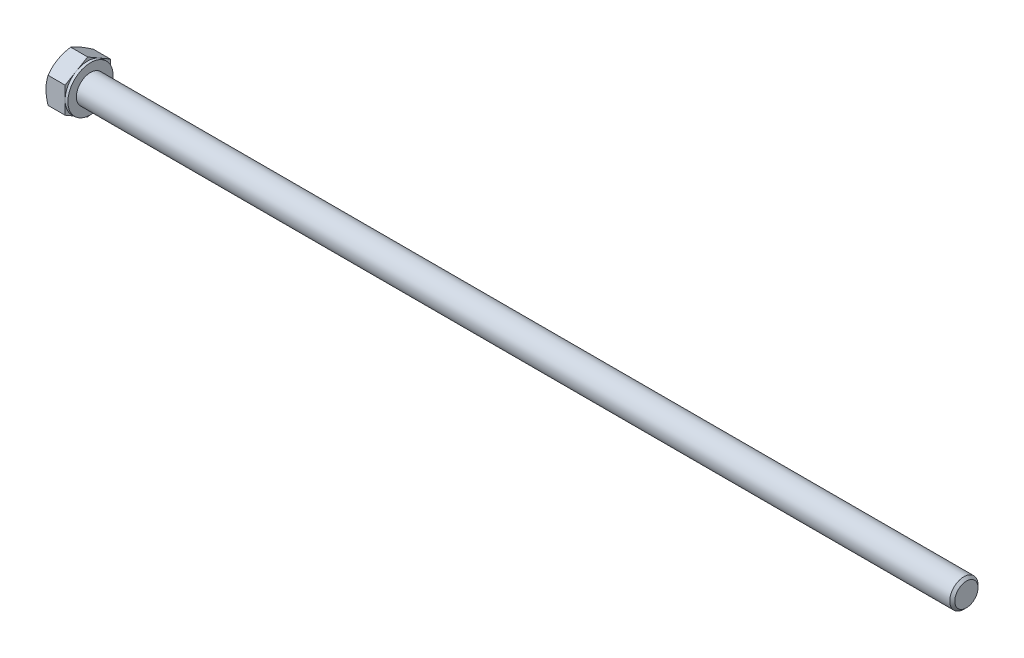
ISO-10303-21;
HEADER;
FILE_DESCRIPTION(('STEP AP214'),'2;1');
FILE_NAME('part.step','',(''),(''),'','','');
FILE_SCHEMA(('AUTOMOTIVE_DESIGN { 1 0 10303 214 1 1 1 1 }'));
ENDSEC;
DATA;
#1=APPLICATION_CONTEXT('core data for automotive mechanical design processes');
#2=APPLICATION_PROTOCOL_DEFINITION('international standard','automotive_design',2000,#1);
#3=PRODUCT_CONTEXT('',#1,'mechanical');
#4=PRODUCT('Part','Part','',(#3));
#5=PRODUCT_RELATED_PRODUCT_CATEGORY('part','',(#4));
#6=PRODUCT_DEFINITION_FORMATION('','',#4);
#7=PRODUCT_DEFINITION_CONTEXT('part definition',#1,'design');
#8=PRODUCT_DEFINITION('design','',#6,#7);
#9=PRODUCT_DEFINITION_SHAPE('','',#8);
#10=(LENGTH_UNIT() NAMED_UNIT(*) SI_UNIT(.MILLI.,.METRE.));
#11=(NAMED_UNIT(*) PLANE_ANGLE_UNIT() SI_UNIT($,.RADIAN.));
#12=(NAMED_UNIT(*) SI_UNIT($,.STERADIAN.) SOLID_ANGLE_UNIT());
#13=UNCERTAINTY_MEASURE_WITH_UNIT(LENGTH_MEASURE(1.E-05),#10,'distance_accuracy_value','');
#14=(GEOMETRIC_REPRESENTATION_CONTEXT(3) GLOBAL_UNCERTAINTY_ASSIGNED_CONTEXT((#13)) GLOBAL_UNIT_ASSIGNED_CONTEXT((#10,
#11,#12)) REPRESENTATION_CONTEXT('',''));
#15=CARTESIAN_POINT('',(0.,0.,0.));
#16=DIRECTION('',(0.,0.,1.));
#17=DIRECTION('',(1.,0.,0.));
#18=AXIS2_PLACEMENT_3D('',#15,#16,#17);
#19=CARTESIAN_POINT('',(3.875,4.61880215351701,0.));
#20=DIRECTION('',(1.,0.,0.));
#21=DIRECTION('',(0.,0.,-1.));
#22=AXIS2_PLACEMENT_3D('',#19,#20,#21);
#23=PLANE('',#22);
#24=CARTESIAN_POINT('',(3.875,0.,0.));
#25=DIRECTION('',(1.,0.,0.));
#26=DIRECTION('',(0.,0.,-1.));
#27=AXIS2_PLACEMENT_3D('',#24,#25,#26);
#28=CIRCLE('',#27,2.5);
#29=CARTESIAN_POINT('',(3.875,0.,-2.5));
#30=VERTEX_POINT('',#29);
#31=EDGE_CURVE('E282',#30,#30,#28,.F.);
#32=ORIENTED_EDGE('',*,*,#31,.T.);
#33=EDGE_LOOP('',(#32));
#34=FACE_BOUND('',#33,.T.);
#35=CARTESIAN_POINT('',(3.875,0.,0.));
#36=DIRECTION('',(1.,0.,0.));
#37=DIRECTION('',(0.,0.,-1.));
#38=AXIS2_PLACEMENT_3D('',#35,#36,#37);
#39=CIRCLE('',#38,4.);
#40=CARTESIAN_POINT('',(3.875,0.,-4.));
#41=VERTEX_POINT('',#40);
#42=EDGE_CURVE('E301',#41,#41,#39,.T.);
#43=ORIENTED_EDGE('',*,*,#42,.T.);
#44=EDGE_LOOP('',(#43));
#45=FACE_BOUND('',#44,.T.);
#46=ADVANCED_FACE('F38',(#34,#45),#23,.T.);
#47=CARTESIAN_POINT('',(0.,0.,0.));
#48=DIRECTION('',(-1.,0.,0.));
#49=DIRECTION('',(0.,0.,1.));
#50=AXIS2_PLACEMENT_3D('',#47,#48,#49);
#51=CYLINDRICAL_SURFACE('',#50,2.5);
#52=ORIENTED_EDGE('',*,*,#31,.F.);
#53=EDGE_LOOP('',(#52));
#54=FACE_BOUND('',#53,.T.);
#55=CARTESIAN_POINT('',(158.43,0.,0.));
#56=DIRECTION('',(-1.,0.,0.));
#57=DIRECTION('',(0.,0.,1.));
#58=AXIS2_PLACEMENT_3D('',#55,#56,#57);
#59=CIRCLE('',#58,2.5);
#60=CARTESIAN_POINT('',(158.43,0.,2.5));
#61=VERTEX_POINT('',#60);
#62=EDGE_CURVE('E279',#61,#61,#59,.T.);
#63=ORIENTED_EDGE('',*,*,#62,.T.);
#64=EDGE_LOOP('',(#63));
#65=FACE_BOUND('',#64,.T.);
#66=ADVANCED_FACE('F253',(#54,#65),#51,.T.);
#67=CARTESIAN_POINT('',(158.875,0.,0.));
#68=DIRECTION('',(-1.,0.,0.));
#69=DIRECTION('',(0.,0.,1.));
#70=AXIS2_PLACEMENT_3D('',#67,#68,#69);
#71=CONICAL_SURFACE('',#70,2.055,0.785398163397387);
#72=ORIENTED_EDGE('',*,*,#62,.F.);
#73=EDGE_LOOP('',(#72));
#74=FACE_BOUND('',#73,.T.);
#75=CARTESIAN_POINT('',(158.875,0.,0.));
#76=DIRECTION('',(-1.,0.,0.));
#77=DIRECTION('',(0.,0.,1.));
#78=AXIS2_PLACEMENT_3D('',#75,#76,#77);
#79=CIRCLE('',#78,2.055);
#80=CARTESIAN_POINT('',(158.875,0.,2.055));
#81=VERTEX_POINT('',#80);
#82=EDGE_CURVE('E277',#81,#81,#79,.T.);
#83=ORIENTED_EDGE('',*,*,#82,.T.);
#84=EDGE_LOOP('',(#83));
#85=FACE_BOUND('',#84,.T.);
#86=ADVANCED_FACE('F258',(#74,#85),#71,.T.);
#87=CARTESIAN_POINT('',(158.875,0.,0.));
#88=DIRECTION('',(-1.,0.,0.));
#89=DIRECTION('',(0.,0.,1.));
#90=AXIS2_PLACEMENT_3D('',#87,#88,#89);
#91=PLANE('',#90);
#92=ORIENTED_EDGE('',*,*,#82,.F.);
#93=EDGE_LOOP('',(#92));
#94=FACE_BOUND('',#93,.T.);
#95=ADVANCED_FACE('F265',(#94),#91,.F.);
#96=CARTESIAN_POINT('',(3.375,4.,0.));
#97=DIRECTION('',(1.,0.,0.));
#98=DIRECTION('',(0.,0.,-1.));
#99=AXIS2_PLACEMENT_3D('',#96,#97,#98);
#100=PLANE('',#99);
#101=DIRECTION('',(0.,0.500000000000002,0.866025403784437));
#102=VECTOR('',#101,1.);
#103=CARTESIAN_POINT('',(3.375,2.3094010767585,-4.));
#104=LINE('',#103,#102);
#105=CARTESIAN_POINT('',(3.375,2.3094010767585,-4.));
#106=VERTEX_POINT('',#105);
#107=CARTESIAN_POINT('',(3.375,3.46410161513775,-2.00000000000001));
#108=VERTEX_POINT('',#107);
#109=EDGE_CURVE('E171',#106,#108,#104,.T.);
#110=ORIENTED_EDGE('',*,*,#109,.T.);
#111=CARTESIAN_POINT('',(3.375,0.,0.));
#112=DIRECTION('',(-1.,0.,0.));
#113=DIRECTION('',(0.,0.,1.));
#114=AXIS2_PLACEMENT_3D('',#111,#112,#113);
#115=CIRCLE('',#114,4.);
#116=CARTESIAN_POINT('',(3.375,0.,-4.));
#117=VERTEX_POINT('',#116);
#118=EDGE_CURVE('E54',#108,#117,#115,.T.);
#119=ORIENTED_EDGE('',*,*,#118,.T.);
#120=DIRECTION('',(0.,1.,0.));
#121=VECTOR('',#120,1.);
#122=CARTESIAN_POINT('',(3.375,2.3094010767585,-4.));
#123=LINE('',#122,#121);
#124=EDGE_CURVE('E43',#117,#106,#123,.T.);
#125=ORIENTED_EDGE('',*,*,#124,.T.);
#126=EDGE_LOOP('',(#110,#119,#125));
#127=FACE_BOUND('',#126,.T.);
#128=ADVANCED_FACE('F268',(#127),#100,.T.);
#129=CARTESIAN_POINT('',(3.375,4.61880215351701,0.));
#130=VERTEX_POINT('',#129);
#131=EDGE_CURVE('E169',#108,#130,#104,.T.);
#132=ORIENTED_EDGE('',*,*,#131,.T.);
#133=DIRECTION('',(0.,-0.500000000000001,0.866025403784438));
#134=VECTOR('',#133,1.);
#135=CARTESIAN_POINT('',(3.375,4.61880215351701,0.));
#136=LINE('',#135,#134);
#137=CARTESIAN_POINT('',(3.375,3.46410161513775,2.));
#138=VERTEX_POINT('',#137);
#139=EDGE_CURVE('E168',#130,#138,#136,.T.);
#140=ORIENTED_EDGE('',*,*,#139,.T.);
#141=EDGE_CURVE('E157',#138,#108,#115,.T.);
#142=ORIENTED_EDGE('',*,*,#141,.T.);
#143=EDGE_LOOP('',(#132,#140,#142));
#144=FACE_BOUND('',#143,.T.);
#145=ADVANCED_FACE('F273',(#144),#100,.T.);
#146=CARTESIAN_POINT('',(3.375,2.30940107675851,3.99999999999999));
#147=VERTEX_POINT('',#146);
#148=EDGE_CURVE('E136',#138,#147,#136,.T.);
#149=ORIENTED_EDGE('',*,*,#148,.T.);
#150=DIRECTION('',(0.,-1.,0.));
#151=VECTOR('',#150,1.);
#152=CARTESIAN_POINT('',(3.375,2.30940107675851,3.99999999999999));
#153=LINE('',#152,#151);
#154=CARTESIAN_POINT('',(3.375,0.,4.));
#155=VERTEX_POINT('',#154);
#156=EDGE_CURVE('E130',#147,#155,#153,.T.);
#157=ORIENTED_EDGE('',*,*,#156,.T.);
#158=EDGE_CURVE('E134',#155,#138,#115,.T.);
#159=ORIENTED_EDGE('',*,*,#158,.T.);
#160=EDGE_LOOP('',(#149,#157,#159));
#161=FACE_BOUND('',#160,.T.);
#162=ADVANCED_FACE('F132',(#161),#100,.T.);
#163=CARTESIAN_POINT('',(3.375,-2.30940107675848,4.));
#164=VERTEX_POINT('',#163);
#165=EDGE_CURVE('E140',#155,#164,#153,.T.);
#166=ORIENTED_EDGE('',*,*,#165,.T.);
#167=DIRECTION('',(0.,-0.500000000000002,-0.866025403784438));
#168=VECTOR('',#167,1.);
#169=CARTESIAN_POINT('',(3.375,-4.61880215351699,0.));
#170=LINE('',#169,#168);
#171=CARTESIAN_POINT('',(3.375,-3.46410161513775,2.00000000000001));
#172=VERTEX_POINT('',#171);
#173=EDGE_CURVE('E147',#164,#172,#170,.T.);
#174=ORIENTED_EDGE('',*,*,#173,.T.);
#175=EDGE_CURVE('E144',#172,#155,#115,.T.);
#176=ORIENTED_EDGE('',*,*,#175,.T.);
#177=EDGE_LOOP('',(#166,#174,#176));
#178=FACE_BOUND('',#177,.T.);
#179=ADVANCED_FACE('F145',(#178),#100,.T.);
#180=CARTESIAN_POINT('',(3.375,-4.61880215351699,0.));
#181=VERTEX_POINT('',#180);
#182=EDGE_CURVE('E163',#172,#181,#170,.T.);
#183=ORIENTED_EDGE('',*,*,#182,.T.);
#184=DIRECTION('',(0.,0.499999999999998,-0.86602540378444));
#185=VECTOR('',#184,1.);
#186=CARTESIAN_POINT('',(3.375,-2.3094010767585,-4.));
#187=LINE('',#186,#185);
#188=CARTESIAN_POINT('',(3.375,-3.46410161513776,-1.99999999999999));
#189=VERTEX_POINT('',#188);
#190=EDGE_CURVE('E337',#181,#189,#187,.T.);
#191=ORIENTED_EDGE('',*,*,#190,.T.);
#192=EDGE_CURVE('E151',#189,#172,#115,.T.);
#193=ORIENTED_EDGE('',*,*,#192,.T.);
#194=EDGE_LOOP('',(#183,#191,#193));
#195=FACE_BOUND('',#194,.T.);
#196=ADVANCED_FACE('F342',(#195),#100,.T.);
#197=CARTESIAN_POINT('',(3.375,-2.3094010767585,-4.));
#198=VERTEX_POINT('',#197);
#199=EDGE_CURVE('E158',#189,#198,#187,.T.);
#200=ORIENTED_EDGE('',*,*,#199,.T.);
#201=EDGE_CURVE('E11',#198,#117,#123,.T.);
#202=ORIENTED_EDGE('',*,*,#201,.T.);
#203=EDGE_CURVE('E355',#117,#189,#115,.T.);
#204=ORIENTED_EDGE('',*,*,#203,.T.);
#205=EDGE_LOOP('',(#200,#202,#204));
#206=FACE_BOUND('',#205,.T.);
#207=ADVANCED_FACE('F274',(#206),#100,.T.);
#208=CARTESIAN_POINT('',(0.,0.,0.));
#209=DIRECTION('',(-1.,0.,0.));
#210=DIRECTION('',(0.,0.,1.));
#211=AXIS2_PLACEMENT_3D('',#208,#209,#210);
#212=CYLINDRICAL_SURFACE('',#211,4.);
#213=ORIENTED_EDGE('',*,*,#118,.F.);
#214=ORIENTED_EDGE('',*,*,#141,.F.);
#215=ORIENTED_EDGE('',*,*,#158,.F.);
#216=ORIENTED_EDGE('',*,*,#175,.F.);
#217=ORIENTED_EDGE('',*,*,#192,.F.);
#218=ORIENTED_EDGE('',*,*,#203,.F.);
#219=EDGE_LOOP('',(#213,#214,#215,#216,#217,#218));
#220=FACE_BOUND('',#219,.T.);
#221=ORIENTED_EDGE('',*,*,#42,.F.);
#222=EDGE_LOOP('',(#221));
#223=FACE_BOUND('',#222,.T.);
#224=ADVANCED_FACE('F154',(#220,#223),#212,.T.);
#225=CARTESIAN_POINT('',(0.,4.61880215351701,0.));
#226=DIRECTION('',(1.,0.,0.));
#227=DIRECTION('',(0.,0.,-1.));
#228=AXIS2_PLACEMENT_3D('',#225,#226,#227);
#229=PLANE('',#228);
#230=CARTESIAN_POINT('',(0.,0.,0.));
#231=DIRECTION('',(1.,0.,0.));
#232=DIRECTION('',(0.,0.,-1.));
#233=AXIS2_PLACEMENT_3D('',#230,#231,#232);
#234=CIRCLE('',#233,4.);
#235=CARTESIAN_POINT('',(0.,0.,-4.));
#236=VERTEX_POINT('',#235);
#237=CARTESIAN_POINT('',(0.,3.46410161513775,-2.00000000000001));
#238=VERTEX_POINT('',#237);
#239=EDGE_CURVE('E300',#236,#238,#234,.T.);
#240=ORIENTED_EDGE('',*,*,#239,.F.);
#241=CARTESIAN_POINT('',(0.,-3.46410161513776,-1.99999999999999));
#242=VERTEX_POINT('',#241);
#243=EDGE_CURVE('E297',#242,#236,#234,.T.);
#244=ORIENTED_EDGE('',*,*,#243,.F.);
#245=CARTESIAN_POINT('',(0.,-3.46410161513775,2.00000000000001));
#246=VERTEX_POINT('',#245);
#247=EDGE_CURVE('E299',#246,#242,#234,.T.);
#248=ORIENTED_EDGE('',*,*,#247,.F.);
#249=CARTESIAN_POINT('',(0.,0.,4.));
#250=VERTEX_POINT('',#249);
#251=EDGE_CURVE('E309',#250,#246,#234,.T.);
#252=ORIENTED_EDGE('',*,*,#251,.F.);
#253=CARTESIAN_POINT('',(0.,0.,0.));
#254=DIRECTION('',(-1.,0.,0.));
#255=DIRECTION('',(0.,0.,1.));
#256=AXIS2_PLACEMENT_3D('',#253,#254,#255);
#257=CIRCLE('',#256,4.);
#258=CARTESIAN_POINT('',(0.,3.46410161513775,2.));
#259=VERTEX_POINT('',#258);
#260=EDGE_CURVE('E172',#250,#259,#257,.T.);
#261=ORIENTED_EDGE('',*,*,#260,.T.);
#262=EDGE_CURVE('E304',#238,#259,#234,.T.);
#263=ORIENTED_EDGE('',*,*,#262,.F.);
#264=EDGE_LOOP('',(#240,#244,#248,#252,#261,#263));
#265=FACE_BOUND('',#264,.T.);
#266=ADVANCED_FACE('F203',(#265),#229,.F.);
#267=CARTESIAN_POINT('',(0.,0.,0.));
#268=DIRECTION('',(1.,0.,0.));
#269=DIRECTION('',(0.,0.,-1.));
#270=AXIS2_PLACEMENT_3D('',#267,#268,#269);
#271=CONICAL_SURFACE('',#270,4.,1.0471975511966);
#272=CARTESIAN_POINT('',(0.357332259074764,2.30928560670467,4.00019999999999));
#273=CARTESIAN_POINT('',(0.29871787364828,2.41077174646171,3.82442084967676));
#274=CARTESIAN_POINT('',(0.245410321462261,2.513133908835,3.64712438367361));
#275=CARTESIAN_POINT('',(0.152361670746402,2.71963072479812,3.28946140682429));
#276=CARTESIAN_POINT('',(0.112653489029703,2.82376904741905,3.10908854102984));
#277=CARTESIAN_POINT('',(0.0508422152802788,3.03075510011796,2.7505781812972));
#278=CARTESIAN_POINT('',(0.028327731522889,3.13357098372492,2.57249584706485));
#279=CARTESIAN_POINT('',(0.00145062314658275,3.33968651028529,2.21549328283349));
#280=CARTESIAN_POINT('',(-0.00293425857305552,3.44298540411435,2.03657435035589));
#281=CARTESIAN_POINT('',(0.00619007293997221,3.63600352522933,1.70225715780326));
#282=CARTESIAN_POINT('',(0.0174589539879965,3.72575165335065,1.54680884001293));
#283=CARTESIAN_POINT('',(0.0531739907981958,3.90466320392055,1.23692494436494));
#284=CARTESIAN_POINT('',(0.0776323457115357,3.99382600759479,1.08249043825587));
#285=CARTESIAN_POINT('',(0.138776064919292,4.17310641015198,0.77196767222542));
#286=CARTESIAN_POINT('',(0.175720603654866,4.26320131938132,0.615918711936896));
#287=CARTESIAN_POINT('',(0.25957007254803,4.44204742827551,0.30614816459616));
#288=CARTESIAN_POINT('',(0.306455302212743,4.53080091904967,0.152422609226221));
#289=CARTESIAN_POINT('',(0.35733225907477,4.61891762357085,-0.000200000000000127));
#290=B_SPLINE_CURVE_WITH_KNOTS('',3,(#272,#273,#274,#275,#276,#277,#278,#279,#280,#281,#282,
#283,#284,#285,#286,#287,#288,#289),.UNSPECIFIED.,.F.,.F.,(4,2,2,2,2,2,2,2,4),(0.,
0.634047835695966,1.26961969224543,1.88946157213122,2.50854226669297,3.04757825393385,
3.58711366126903,4.13861653143763,4.68903648037742),.UNSPECIFIED.);
#291=CARTESIAN_POINT('',(0.357265589908165,4.61880215351701,0.));
#292=VERTEX_POINT('',#291);
#293=EDGE_CURVE('E222',#259,#292,#290,.T.);
#294=ORIENTED_EDGE('',*,*,#293,.T.);
#295=CARTESIAN_POINT('',(0.35733225907477,4.61891762357085,0.0002));
#296=CARTESIAN_POINT('',(0.298717873648285,4.51743148381381,-0.175579150323228));
#297=CARTESIAN_POINT('',(0.245410321462265,4.41506932144052,-0.352875616326381));
#298=CARTESIAN_POINT('',(0.152361670746406,4.2085725054774,-0.710538593175707));
#299=CARTESIAN_POINT('',(0.112653489029706,4.10443418285647,-0.890911458970151));
#300=CARTESIAN_POINT('',(0.0508422152802803,3.89744813015756,-1.24942181870279));
#301=CARTESIAN_POINT('',(0.0283277315228899,3.7946322465506,-1.42750415293514));
#302=CARTESIAN_POINT('',(0.00145062314658219,3.58851671999023,-1.78450671716651));
#303=CARTESIAN_POINT('',(-0.00293425857305679,3.48521782616117,-1.9634256496441));
#304=CARTESIAN_POINT('',(0.00619007293996969,3.29219970504619,-2.29774284219673));
#305=CARTESIAN_POINT('',(0.0174589539879935,3.20245157692486,-2.45319115998707));
#306=CARTESIAN_POINT('',(0.0531739907981918,3.02354002635497,-2.76307505563506));
#307=CARTESIAN_POINT('',(0.0776323457115313,2.93437722268072,-2.91750956174413));
#308=CARTESIAN_POINT('',(0.138776064919287,2.75509682012354,-3.22803232777458));
#309=CARTESIAN_POINT('',(0.175720603654861,2.6650019108942,-3.3840812880631));
#310=CARTESIAN_POINT('',(0.259570072548025,2.486155802,-3.69385183540384));
#311=CARTESIAN_POINT('',(0.306455302212738,2.39740231122584,-3.84757739077378));
#312=CARTESIAN_POINT('',(0.357332259074764,2.30928560670466,-4.0002));
#313=B_SPLINE_CURVE_WITH_KNOTS('',3,(#295,#296,#297,#298,#299,#300,#301,#302,#303,#304,#305,
#306,#307,#308,#309,#310,#311,#312),.UNSPECIFIED.,.F.,.F.,(4,2,2,2,2,2,2,2,4),(0.,
0.634047835695967,1.26961969224544,1.88946157213122,2.50854226669297,3.04757825393386,
3.58711366126904,4.13861653143764,4.68903648037744),.UNSPECIFIED.);
#314=EDGE_CURVE('E62',#292,#238,#313,.T.);
#315=ORIENTED_EDGE('',*,*,#314,.T.);
#316=ORIENTED_EDGE('',*,*,#262,.T.);
#317=EDGE_LOOP('',(#294,#315,#316));
#318=FACE_BOUND('',#317,.T.);
#319=ADVANCED_FACE('F351',(#318),#271,.T.);
#320=CARTESIAN_POINT('',(2.00011120589741,-6.3020384276111,4.));
#321=CARTESIAN_POINT('',(1.91454696498874,-6.12645846908572,4.));
#322=CARTESIAN_POINT('',(1.82977515877991,-5.95048585830453,4.));
#323=CARTESIAN_POINT('',(1.66226027831944,-5.59754684504874,4.));
#324=CARTESIAN_POINT('',(1.57951750565516,-5.42058029958675,4.));
#325=CARTESIAN_POINT('',(1.41610926315702,-5.06457985358149,4.));
#326=CARTESIAN_POINT('',(1.33545672742031,-4.88553999633135,4.));
#327=CARTESIAN_POINT('',(1.17732358085362,-4.52607013308823,4.));
#328=CARTESIAN_POINT('',(1.09984282639236,-4.34564019048465,4.));
#329=CARTESIAN_POINT('',(0.946328318347805,-3.97695712450864,4.));
#330=CARTESIAN_POINT('',(0.870432704529681,-3.78864617668019,4.));
#331=CARTESIAN_POINT('',(0.72415021597338,-3.40985798992393,4.));
#332=CARTESIAN_POINT('',(0.653763945273162,-3.21938051607553,4.));
#333=CARTESIAN_POINT('',(0.520275623504074,-2.83628177128503,4.));
#334=CARTESIAN_POINT('',(0.457159651374146,-2.64366539864626,4.));
#335=CARTESIAN_POINT('',(0.340171517554833,-2.25567134331567,4.));
#336=CARTESIAN_POINT('',(0.286296547637712,-2.06029451909568,4.));
#337=CARTESIAN_POINT('',(0.190596079795562,-1.6677501958015,4.));
#338=CARTESIAN_POINT('',(0.14870305551646,-1.47059946092577,4.));
#339=CARTESIAN_POINT('',(0.0792701945625763,-1.07374632347738,4.));
#340=CARTESIAN_POINT('',(0.0517287925825687,-0.874044201614994,4.));
#341=CARTESIAN_POINT('',(0.0135517369810941,-0.475733691865648,4.));
#342=CARTESIAN_POINT('',(0.00269106568149997,-0.277147418102496,3.99999999999999));
#343=CARTESIAN_POINT('',(-0.00180277185473935,0.120241437274137,3.99999999999999));
#344=CARTESIAN_POINT('',(0.00456430935448055,0.31904402195354,3.99999999999999));
#345=CARTESIAN_POINT('',(0.0293199842587305,0.653649133068306,3.99999999999999));
#346=CARTESIAN_POINT('',(0.0433487696608956,0.789796206499822,3.99999999999999));
#347=CARTESIAN_POINT('',(0.0786650587211735,1.0611517992991,3.99999999999999));
#348=CARTESIAN_POINT('',(0.0999534653997809,1.19636019976991,3.99999999999999));
#349=CARTESIAN_POINT('',(0.173595113230302,1.60036108975571,3.99999999999999));
#350=CARTESIAN_POINT('',(0.235713609865279,1.86739658303732,3.99999999999999));
#351=CARTESIAN_POINT('',(0.344187907647022,2.26690842404959,3.99999999999999));
#352=CARTESIAN_POINT('',(0.383434484333357,2.40143348571873,3.99999999999999));
#353=CARTESIAN_POINT('',(0.466191102609246,2.66917849490936,3.99999999999999));
#354=CARTESIAN_POINT('',(0.509701177188774,2.80239843232331,3.99999999999999));
#355=CARTESIAN_POINT('',(0.600271094434187,3.06757339383922,3.99999999999999));
#356=CARTESIAN_POINT('',(0.647329943862151,3.19952876030404,3.99999999999999));
#357=CARTESIAN_POINT('',(0.744425096631931,3.46233234223974,3.99999999999999));
#358=CARTESIAN_POINT('',(0.794461330917676,3.59318058330842,3.99999999999999));
#359=CARTESIAN_POINT('',(0.933355739925497,3.94627302392211,3.99999999999999));
#360=CARTESIAN_POINT('',(1.0245987610664,4.16757823857485,3.99999999999999));
#361=CARTESIAN_POINT('',(1.212472284956,4.60789849928791,3.99999999999999));
#362=CARTESIAN_POINT('',(1.30910339372388,4.82691328443149,3.99999999999999));
#363=CARTESIAN_POINT('',(1.50647026715799,5.26317250533756,3.99999999999999));
#364=CARTESIAN_POINT('',(1.60720747010152,5.4804162882198,3.99999999999999));
#365=CARTESIAN_POINT('',(1.81181128644257,5.91342831956034,3.99999999999999));
#366=CARTESIAN_POINT('',(1.91567799687904,6.12919652200916,3.99999999999999));
#367=CARTESIAN_POINT('',(2.12601769056009,6.55988022094133,3.99999999999999));
#368=CARTESIAN_POINT('',(2.23249454580639,6.77479382248027,3.99999999999999));
#369=CARTESIAN_POINT('',(2.44739203770408,7.20364803216284,3.99999999999999));
#370=CARTESIAN_POINT('',(2.55581269515436,7.41758862986448,3.99999999999999));
#371=CARTESIAN_POINT('',(2.88334503640577,8.05812603677696,3.99999999999999));
#372=CARTESIAN_POINT('',(3.10477549508713,8.48353660654959,3.99999999999999));
#373=CARTESIAN_POINT('',(3.52798949521968,9.28704830568599,3.99999999999999));
#374=CARTESIAN_POINT('',(3.72935795236482,9.66536913109686,3.99999999999999));
#375=CARTESIAN_POINT('',(4.13451859351915,10.4207405604373,3.99999999999999));
#376=CARTESIAN_POINT('',(4.33831092861575,10.7977910832853,3.99999999999999));
#377=CARTESIAN_POINT('',(4.74699525708428,11.5496417902084,3.99999999999999));
#378=CARTESIAN_POINT('',(4.95188119417862,11.9244452714923,3.99999999999999));
#379=CARTESIAN_POINT('',(5.36302659718326,12.6732594632005,3.99999999999999));
#380=CARTESIAN_POINT('',(5.56928595205575,13.0472702345667,3.99999999999998));
#381=CARTESIAN_POINT('',(5.77604503500379,13.42100281196,3.99999999999998));
#382=B_SPLINE_CURVE_WITH_KNOTS('',3,(#320,#321,#322,#323,#324,#325,#326,#327,#328,#329,#330,
#331,#332,#333,#334,#335,#336,#337,#338,#339,#340,#341,#342,#343,#344,#345,#346,#347,#348,#349,
#350,#351,#352,#353,#354,#355,#356,#357,#358,#359,#360,#361,#362,#363,#364,#365,#366,#367,#368,
#369,#370,#371,#372,#373,#374,#375,#376,#377,#378,#379,#380,#381),.UNSPECIFIED.,.F.,.F.,(4,2,2,
2,2,2,2,2,2,2,2,2,2,2,2,2,2,2,2,2,2,2,2,2,2,2,2,2,2,2,4),(0.,0.585964080082645,1.1720147339736,
1.76109183587771,2.35014223237614,2.95916537364922,3.56825519425103,4.17615863853846,
4.78387701983942,5.38809979056438,5.99225664601461,6.58818973021545,7.18413137397508,
7.59453803053125,8.00499575598946,8.82630884150171,9.24666973898508,9.66703388938197,
10.0872808210163,10.5075180094363,11.2255416710968,11.9436462552168,12.6620045748535,
13.3803851921263,14.0999050723894,14.8194326561991,16.2581595564571,17.5438734456803,
18.8296679016496,20.1111105471136,21.3924508191106),.UNSPECIFIED.);
#383=CARTESIAN_POINT('',(0.35726558990816,2.30940107675851,3.99999999999999));
#384=VERTEX_POINT('',#383);
#385=EDGE_CURVE('E236',#250,#384,#382,.T.);
#386=ORIENTED_EDGE('',*,*,#385,.T.);
#387=EDGE_CURVE('E235',#384,#259,#290,.T.);
#388=ORIENTED_EDGE('',*,*,#387,.T.);
#389=ORIENTED_EDGE('',*,*,#260,.F.);
#390=EDGE_LOOP('',(#386,#388,#389));
#391=FACE_BOUND('',#390,.T.);
#392=ADVANCED_FACE('F347',(#391),#271,.T.);
#393=CARTESIAN_POINT('',(0.357265589908154,-2.30940107675848,4.));
#394=VERTEX_POINT('',#393);
#395=EDGE_CURVE('E280',#394,#250,#382,.T.);
#396=ORIENTED_EDGE('',*,*,#395,.T.);
#397=ORIENTED_EDGE('',*,*,#251,.T.);
#398=CARTESIAN_POINT('',(0.357332259074758,-4.61891762357083,-0.00020000000000029));
#399=CARTESIAN_POINT('',(0.298717873648274,-4.51743148381379,0.175579150323227));
#400=CARTESIAN_POINT('',(0.245410321462254,-4.4150693214405,0.352875616326379));
#401=CARTESIAN_POINT('',(0.152361670746395,-4.20857250547738,0.710538593175704));
#402=CARTESIAN_POINT('',(0.112653489029696,-4.10443418285645,0.890911458970147));
#403=CARTESIAN_POINT('',(0.0508422152802703,-3.89744813015754,1.24942181870278));
#404=CARTESIAN_POINT('',(0.0283277315228798,-3.79463224655058,1.42750415293514));
#405=CARTESIAN_POINT('',(0.00145062314657242,-3.58851671999021,1.7845067171665));
#406=CARTESIAN_POINT('',(-0.00293425857306621,-3.48521782616116,1.96342564964409));
#407=CARTESIAN_POINT('',(0.00619007293996036,-3.29219970504617,2.29774284219672));
#408=CARTESIAN_POINT('',(0.017458953987984,-3.20245157692485,2.45319115998706));
#409=CARTESIAN_POINT('',(0.0531739907981826,-3.02354002635495,2.76307505563505));
#410=CARTESIAN_POINT('',(0.0776323457115225,-2.93437722268071,2.91750956174412));
#411=CARTESIAN_POINT('',(0.138776064919279,-2.75509682012352,3.22803232777457));
#412=CARTESIAN_POINT('',(0.175720603654853,-2.66500191089418,3.3840812880631));
#413=CARTESIAN_POINT('',(0.259570072548017,-2.48615580199999,3.69385183540383));
#414=CARTESIAN_POINT('',(0.30645530221273,-2.39740231122583,3.84757739077377));
#415=CARTESIAN_POINT('',(0.357332259074757,-2.30928560670464,4.0002));
#416=B_SPLINE_CURVE_WITH_KNOTS('',3,(#398,#399,#400,#401,#402,#403,#404,#405,#406,#407,#408,
#409,#410,#411,#412,#413,#414,#415),.UNSPECIFIED.,.F.,.F.,(4,2,2,2,2,2,2,2,4),(0.,
0.634047835695964,1.26961969224543,1.88946157213122,2.50854226669296,3.04757825393385,
3.58711366126903,4.13861653143764,4.68903648037743),.UNSPECIFIED.);
#417=EDGE_CURVE('E224',#246,#394,#416,.T.);
#418=ORIENTED_EDGE('',*,*,#417,.T.);
#419=EDGE_LOOP('',(#396,#397,#418));
#420=FACE_BOUND('',#419,.T.);
#421=ADVANCED_FACE('F192',(#420),#271,.T.);
#422=CARTESIAN_POINT('',(0.357265589908153,-4.61880215351699,0.));
#423=VERTEX_POINT('',#422);
#424=EDGE_CURVE('E216',#423,#246,#416,.T.);
#425=ORIENTED_EDGE('',*,*,#424,.T.);
#426=ORIENTED_EDGE('',*,*,#247,.T.);
#427=CARTESIAN_POINT('',(0.357332259074767,-2.30928560670467,-4.0002));
#428=CARTESIAN_POINT('',(0.298717873648282,-2.4107717464617,-3.82442084967677));
#429=CARTESIAN_POINT('',(0.245410321462262,-2.51313390883499,-3.64712438367362));
#430=CARTESIAN_POINT('',(0.152361670746403,-2.71963072479811,-3.28946140682429));
#431=CARTESIAN_POINT('',(0.112653489029703,-2.82376904741904,-3.10908854102985));
#432=CARTESIAN_POINT('',(0.0508422152802768,-3.03075510011795,-2.75057818129721));
#433=CARTESIAN_POINT('',(0.0283277315228864,-3.13357098372491,-2.57249584706486));
#434=CARTESIAN_POINT('',(0.00145062314657872,-3.33968651028528,-2.21549328283349));
#435=CARTESIAN_POINT('',(-0.00293425857306035,-3.44298540411434,-2.0365743503559));
#436=CARTESIAN_POINT('',(0.00619007293996598,-3.63600352522932,-1.70225715780327));
#437=CARTESIAN_POINT('',(0.0174589539879896,-3.72575165335064,-1.54680884001293));
#438=CARTESIAN_POINT('',(0.0531739907981878,-3.90466320392053,-1.23692494436494));
#439=CARTESIAN_POINT('',(0.0776323457115273,-3.99382600759477,-1.08249043825587));
#440=CARTESIAN_POINT('',(0.138776064919283,-4.17310641015196,-0.771967672225421));
#441=CARTESIAN_POINT('',(0.175720603654856,-4.2632013193813,-0.615918711936897));
#442=CARTESIAN_POINT('',(0.259570072548018,-4.44204742827549,-0.306148164596161));
#443=CARTESIAN_POINT('',(0.306455302212731,-4.53080091904965,-0.152422609226221));
#444=CARTESIAN_POINT('',(0.357332259074757,-4.61891762357083,0.000199999999999552));
#445=B_SPLINE_CURVE_WITH_KNOTS('',3,(#427,#428,#429,#430,#431,#432,#433,#434,#435,#436,#437,
#438,#439,#440,#441,#442,#443,#444),.UNSPECIFIED.,.F.,.F.,(4,2,2,2,2,2,2,2,4),(0.,
0.634047835695966,1.26961969224543,1.88946157213122,2.50854226669297,3.04757825393386,
3.58711366126903,4.13861653143763,4.68903648037742),.UNSPECIFIED.);
#446=EDGE_CURVE('E223',#242,#423,#445,.T.);
#447=ORIENTED_EDGE('',*,*,#446,.T.);
#448=EDGE_LOOP('',(#425,#426,#447));
#449=FACE_BOUND('',#448,.T.);
#450=ADVANCED_FACE('F318',(#449),#271,.T.);
#451=CARTESIAN_POINT('',(0.35726558990816,2.3094010767585,-4.));
#452=VERTEX_POINT('',#451);
#453=EDGE_CURVE('E225',#238,#452,#313,.T.);
#454=ORIENTED_EDGE('',*,*,#453,.T.);
#455=CARTESIAN_POINT('',(2.00011120589743,-6.30203842761113,-4.));
#456=CARTESIAN_POINT('',(1.91454696498875,-6.12645846908575,-4.));
#457=CARTESIAN_POINT('',(1.82977515877993,-5.95048585830456,-4.));
#458=CARTESIAN_POINT('',(1.66226027831945,-5.59754684504877,-4.));
#459=CARTESIAN_POINT('',(1.57951750565517,-5.42058029958678,-4.));
#460=CARTESIAN_POINT('',(1.41610926315704,-5.06457985358152,-4.));
#461=CARTESIAN_POINT('',(1.33545672742033,-4.88553999633137,-4.));
#462=CARTESIAN_POINT('',(1.17732358085363,-4.52607013308825,-4.));
#463=CARTESIAN_POINT('',(1.09984282639237,-4.34564019048468,-4.));
#464=CARTESIAN_POINT('',(0.946328318347817,-3.97695712450867,-4.));
#465=CARTESIAN_POINT('',(0.870432704529692,-3.78864617668021,-4.));
#466=CARTESIAN_POINT('',(0.72415021597339,-3.40985798992395,-4.));
#467=CARTESIAN_POINT('',(0.653763945273172,-3.21938051607555,-4.));
#468=CARTESIAN_POINT('',(0.520275623504084,-2.83628177128505,-4.));
#469=CARTESIAN_POINT('',(0.457159651374156,-2.64366539864628,-4.));
#470=CARTESIAN_POINT('',(0.340171517554842,-2.25567134331569,-4.));
#471=CARTESIAN_POINT('',(0.286296547637721,-2.0602945190957,-4.));
#472=CARTESIAN_POINT('',(0.19059607979557,-1.66775019580152,-4.));
#473=CARTESIAN_POINT('',(0.148703055516466,-1.47059946092578,-4.));
#474=CARTESIAN_POINT('',(0.0792701945625822,-1.07374632347739,-4.));
#475=CARTESIAN_POINT('',(0.0517287925825746,-0.87404420161501,-4.));
#476=CARTESIAN_POINT('',(0.013551736981099,-0.475733691865664,-4.));
#477=CARTESIAN_POINT('',(0.00269106568150394,-0.277147418102511,-4.));
#478=CARTESIAN_POINT('',(-0.00180277185473634,0.120241437274123,-4.));
#479=CARTESIAN_POINT('',(0.00456430935448345,0.319044021953526,-4.));
#480=CARTESIAN_POINT('',(0.0293199842587329,0.653649133068293,-4.));
#481=CARTESIAN_POINT('',(0.0433487696608975,0.789796206499808,-4.));
#482=CARTESIAN_POINT('',(0.0786650587211749,1.06115179929909,-4.));
#483=CARTESIAN_POINT('',(0.0999534653997824,1.19636019976989,-4.));
#484=CARTESIAN_POINT('',(0.173595113230303,1.6003610897557,-4.));
#485=CARTESIAN_POINT('',(0.235713609865279,1.86739658303731,-4.));
#486=CARTESIAN_POINT('',(0.344187907647022,2.26690842404957,-4.));
#487=CARTESIAN_POINT('',(0.383434484333357,2.40143348571872,-4.));
#488=CARTESIAN_POINT('',(0.466191102609246,2.66917849490934,-4.));
#489=CARTESIAN_POINT('',(0.509701177188773,2.8023984323233,-4.));
#490=CARTESIAN_POINT('',(0.600271094434185,3.06757339383921,-4.));
#491=CARTESIAN_POINT('',(0.647329943862149,3.19952876030403,-4.));
#492=CARTESIAN_POINT('',(0.744425096631928,3.46233234223972,-4.));
#493=CARTESIAN_POINT('',(0.794461330917673,3.5931805833084,-4.));
#494=CARTESIAN_POINT('',(0.933355739925494,3.9462730239221,-4.));
#495=CARTESIAN_POINT('',(1.0245987610664,4.16757823857484,-4.));
#496=CARTESIAN_POINT('',(1.21247228495599,4.6078984992879,-4.));
#497=CARTESIAN_POINT('',(1.30910339372387,4.82691328443148,-4.));
#498=CARTESIAN_POINT('',(1.50647026715798,5.26317250533754,-4.));
#499=CARTESIAN_POINT('',(1.60720747010151,5.48041628821979,-4.));
#500=CARTESIAN_POINT('',(1.81181128644257,5.91342831956033,-4.));
#501=CARTESIAN_POINT('',(1.91567799687904,6.12919652200915,-4.));
#502=CARTESIAN_POINT('',(2.12601769056008,6.55988022094132,-4.));
#503=CARTESIAN_POINT('',(2.23249454580639,6.77479382248026,-4.));
#504=CARTESIAN_POINT('',(2.44739203770407,7.20364803216283,-4.));
#505=CARTESIAN_POINT('',(2.55581269515436,7.41758862986447,-4.));
#506=CARTESIAN_POINT('',(2.88334503640577,8.05812603677695,-4.));
#507=CARTESIAN_POINT('',(3.10477549508713,8.48353660654958,-4.));
#508=CARTESIAN_POINT('',(3.52798949521967,9.28704830568598,-4.));
#509=CARTESIAN_POINT('',(3.72935795236482,9.66536913109685,-4.));
#510=CARTESIAN_POINT('',(4.13451859351915,10.4207405604373,-4.));
#511=CARTESIAN_POINT('',(4.33831092861575,10.7977910832853,-4.));
#512=CARTESIAN_POINT('',(4.74699525708428,11.5496417902084,-4.));
#513=CARTESIAN_POINT('',(4.95188119417862,11.9244452714923,-4.));
#514=CARTESIAN_POINT('',(5.36302659718326,12.6732594632005,-4.));
#515=CARTESIAN_POINT('',(5.56928595205576,13.0472702345667,-4.));
#516=CARTESIAN_POINT('',(5.7760450350038,13.42100281196,-4.));
#517=B_SPLINE_CURVE_WITH_KNOTS('',3,(#455,#456,#457,#458,#459,#460,#461,#462,#463,#464,#465,
#466,#467,#468,#469,#470,#471,#472,#473,#474,#475,#476,#477,#478,#479,#480,#481,#482,#483,#484,
#485,#486,#487,#488,#489,#490,#491,#492,#493,#494,#495,#496,#497,#498,#499,#500,#501,#502,#503,
#504,#505,#506,#507,#508,#509,#510,#511,#512,#513,#514,#515,#516),.UNSPECIFIED.,.F.,.F.,(4,2,2,
2,2,2,2,2,2,2,2,2,2,2,2,2,2,2,2,2,2,2,2,2,2,2,2,2,2,2,4),(0.,0.585964080082647,1.17201473397361,
1.76109183587772,2.35014223237615,2.95916537364923,3.56825519425104,4.17615863853847,
4.78387701983944,5.3880997905644,5.99225664601463,6.58818973021547,7.1841313739751,
7.59453803053127,8.00499575598948,8.82630884150173,9.2466697389851,9.66703388938198,
10.0872808210163,10.5075180094363,11.2255416710968,11.9436462552169,12.6620045748535,
13.3803851921263,14.0999050723894,14.8194326561991,16.2581595564571,17.5438734456803,
18.8296679016496,20.1111105471136,21.3924508191106),.UNSPECIFIED.);
#518=EDGE_CURVE('E184',#452,#236,#517,.F.);
#519=ORIENTED_EDGE('',*,*,#518,.T.);
#520=ORIENTED_EDGE('',*,*,#239,.T.);
#521=EDGE_LOOP('',(#454,#519,#520));
#522=FACE_BOUND('',#521,.T.);
#523=ADVANCED_FACE('F332',(#522),#271,.T.);
#524=CARTESIAN_POINT('',(0.357265589908045,-2.30940107675868,-4.));
#525=VERTEX_POINT('',#524);
#526=EDGE_CURVE('E185',#525,#242,#445,.T.);
#527=ORIENTED_EDGE('',*,*,#526,.T.);
#528=ORIENTED_EDGE('',*,*,#243,.T.);
#529=EDGE_CURVE('E175',#236,#525,#517,.F.);
#530=ORIENTED_EDGE('',*,*,#529,.T.);
#531=EDGE_LOOP('',(#527,#528,#530));
#532=FACE_BOUND('',#531,.T.);
#533=ADVANCED_FACE('F201',(#532),#271,.T.);
#534=CARTESIAN_POINT('',(3.875,2.3094010767585,-4.));
#535=DIRECTION('',(0.,0.,1.));
#536=DIRECTION('',(0.,-1.,0.));
#537=AXIS2_PLACEMENT_3D('',#534,#535,#536);
#538=PLANE('',#537);
#539=ORIENTED_EDGE('',*,*,#201,.F.);
#540=DIRECTION('',(-1.,0.,0.));
#541=VECTOR('',#540,1.);
#542=CARTESIAN_POINT('',(3.875,-2.3094010767585,-4.));
#543=LINE('',#542,#541);
#544=EDGE_CURVE('E288',#198,#525,#543,.T.);
#545=ORIENTED_EDGE('',*,*,#544,.T.);
#546=ORIENTED_EDGE('',*,*,#529,.F.);
#547=ORIENTED_EDGE('',*,*,#518,.F.);
#548=DIRECTION('',(-1.,0.,0.));
#549=VECTOR('',#548,1.);
#550=CARTESIAN_POINT('',(3.875,2.3094010767585,-4.));
#551=LINE('',#550,#549);
#552=EDGE_CURVE('E286',#106,#452,#551,.T.);
#553=ORIENTED_EDGE('',*,*,#552,.F.);
#554=ORIENTED_EDGE('',*,*,#124,.F.);
#555=EDGE_LOOP('',(#539,#545,#546,#547,#553,#554));
#556=FACE_BOUND('',#555,.T.);
#557=ADVANCED_FACE('F196',(#556),#538,.F.);
#558=CARTESIAN_POINT('',(3.875,-2.3094010767585,-4.));
#559=DIRECTION('',(0.,0.86602540378444,0.499999999999998));
#560=DIRECTION('',(0.,-0.499999999999998,0.86602540378444));
#561=AXIS2_PLACEMENT_3D('',#558,#559,#560);
#562=PLANE('',#561);
#563=ORIENTED_EDGE('',*,*,#190,.F.);
#564=DIRECTION('',(-1.,0.,0.));
#565=VECTOR('',#564,1.);
#566=CARTESIAN_POINT('',(3.875,-4.61880215351699,0.));
#567=LINE('',#566,#565);
#568=EDGE_CURVE('E290',#181,#423,#567,.T.);
#569=ORIENTED_EDGE('',*,*,#568,.T.);
#570=ORIENTED_EDGE('',*,*,#446,.F.);
#571=ORIENTED_EDGE('',*,*,#526,.F.);
#572=ORIENTED_EDGE('',*,*,#544,.F.);
#573=ORIENTED_EDGE('',*,*,#199,.F.);
#574=EDGE_LOOP('',(#563,#569,#570,#571,#572,#573));
#575=FACE_BOUND('',#574,.T.);
#576=ADVANCED_FACE('F200',(#575),#562,.F.);
#577=CARTESIAN_POINT('',(3.875,-4.61880215351699,0.));
#578=DIRECTION('',(0.,0.866025403784438,-0.500000000000002));
#579=DIRECTION('',(0.,0.500000000000002,0.866025403784438));
#580=AXIS2_PLACEMENT_3D('',#577,#578,#579);
#581=PLANE('',#580);
#582=ORIENTED_EDGE('',*,*,#173,.F.);
#583=DIRECTION('',(-1.,0.,0.));
#584=VECTOR('',#583,1.);
#585=CARTESIAN_POINT('',(3.875,-2.30940107675848,4.));
#586=LINE('',#585,#584);
#587=EDGE_CURVE('E162',#164,#394,#586,.T.);
#588=ORIENTED_EDGE('',*,*,#587,.T.);
#589=ORIENTED_EDGE('',*,*,#417,.F.);
#590=ORIENTED_EDGE('',*,*,#424,.F.);
#591=ORIENTED_EDGE('',*,*,#568,.F.);
#592=ORIENTED_EDGE('',*,*,#182,.F.);
#593=EDGE_LOOP('',(#582,#588,#589,#590,#591,#592));
#594=FACE_BOUND('',#593,.T.);
#595=ADVANCED_FACE('F208',(#594),#581,.F.);
#596=CARTESIAN_POINT('',(3.875,2.30940107675851,3.99999999999999));
#597=DIRECTION('',(0.,0.,-1.));
#598=DIRECTION('',(0.,1.,0.));
#599=AXIS2_PLACEMENT_3D('',#596,#597,#598);
#600=PLANE('',#599);
#601=ORIENTED_EDGE('',*,*,#156,.F.);
#602=DIRECTION('',(-1.,0.,0.));
#603=VECTOR('',#602,1.);
#604=CARTESIAN_POINT('',(3.875,2.30940107675851,3.99999999999999));
#605=LINE('',#604,#603);
#606=EDGE_CURVE('E293',#147,#384,#605,.T.);
#607=ORIENTED_EDGE('',*,*,#606,.T.);
#608=ORIENTED_EDGE('',*,*,#385,.F.);
#609=ORIENTED_EDGE('',*,*,#395,.F.);
#610=ORIENTED_EDGE('',*,*,#587,.F.);
#611=ORIENTED_EDGE('',*,*,#165,.F.);
#612=EDGE_LOOP('',(#601,#607,#608,#609,#610,#611));
#613=FACE_BOUND('',#612,.T.);
#614=ADVANCED_FACE('F160',(#613),#600,.F.);
#615=CARTESIAN_POINT('',(3.875,4.61880215351701,0.));
#616=DIRECTION('',(0.,-0.866025403784438,-0.500000000000001));
#617=DIRECTION('',(0.,0.500000000000001,-0.866025403784438));
#618=AXIS2_PLACEMENT_3D('',#615,#616,#617);
#619=PLANE('',#618);
#620=ORIENTED_EDGE('',*,*,#139,.F.);
#621=DIRECTION('',(-1.,0.,0.));
#622=VECTOR('',#621,1.);
#623=CARTESIAN_POINT('',(3.875,4.61880215351701,0.));
#624=LINE('',#623,#622);
#625=EDGE_CURVE('E295',#130,#292,#624,.T.);
#626=ORIENTED_EDGE('',*,*,#625,.T.);
#627=ORIENTED_EDGE('',*,*,#293,.F.);
#628=ORIENTED_EDGE('',*,*,#387,.F.);
#629=ORIENTED_EDGE('',*,*,#606,.F.);
#630=ORIENTED_EDGE('',*,*,#148,.F.);
#631=EDGE_LOOP('',(#620,#626,#627,#628,#629,#630));
#632=FACE_BOUND('',#631,.T.);
#633=ADVANCED_FACE('F242',(#632),#619,.F.);
#634=CARTESIAN_POINT('',(3.875,2.3094010767585,-4.));
#635=DIRECTION('',(0.,-0.866025403784437,0.500000000000002));
#636=DIRECTION('',(0.,-0.500000000000002,-0.866025403784437));
#637=AXIS2_PLACEMENT_3D('',#634,#635,#636);
#638=PLANE('',#637);
#639=ORIENTED_EDGE('',*,*,#109,.F.);
#640=ORIENTED_EDGE('',*,*,#552,.T.);
#641=ORIENTED_EDGE('',*,*,#453,.F.);
#642=ORIENTED_EDGE('',*,*,#314,.F.);
#643=ORIENTED_EDGE('',*,*,#625,.F.);
#644=ORIENTED_EDGE('',*,*,#131,.F.);
#645=EDGE_LOOP('',(#639,#640,#641,#642,#643,#644));
#646=FACE_BOUND('',#645,.T.);
#647=ADVANCED_FACE('F40',(#646),#638,.F.);
#648=CLOSED_SHELL('',(#46,#66,#86,#95,#128,#145,#162,#179,#196,#207,#224,#266,#319,#392,#421,
#450,#523,#533,#557,#576,#595,#614,#633,#647));
#649=MANIFOLD_SOLID_BREP('B2',#648);
#650=ADVANCED_BREP_SHAPE_REPRESENTATION('',(#18,#649),#14);
#651=SHAPE_DEFINITION_REPRESENTATION(#9,#650);
ENDSEC;
END-ISO-10303-21;
